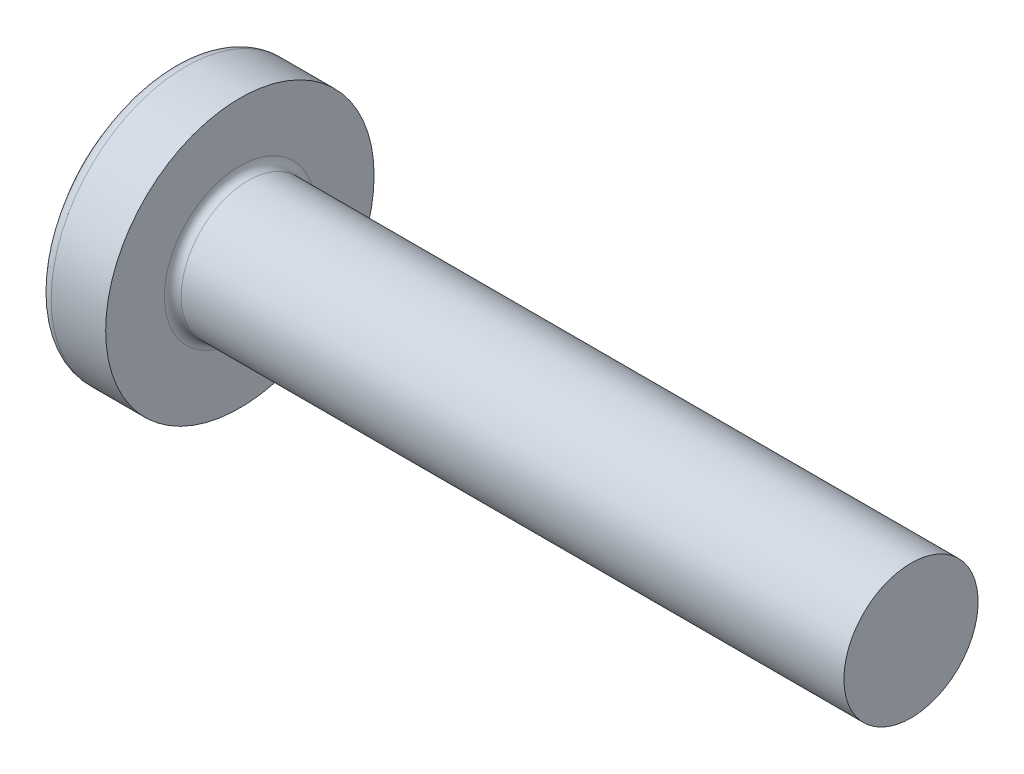
ISO-10303-21;
HEADER;
FILE_DESCRIPTION(('STEP AP214'),'2;1');
FILE_NAME('part.step','',(''),(''),'','','');
FILE_SCHEMA(('AUTOMOTIVE_DESIGN { 1 0 10303 214 1 1 1 1 }'));
ENDSEC;
DATA;
#1=APPLICATION_CONTEXT('core data for automotive mechanical design processes');
#2=APPLICATION_PROTOCOL_DEFINITION('international standard','automotive_design',2000,#1);
#3=PRODUCT_CONTEXT('',#1,'mechanical');
#4=PRODUCT('Part','Part','',(#3));
#5=PRODUCT_RELATED_PRODUCT_CATEGORY('part','',(#4));
#6=PRODUCT_DEFINITION_FORMATION('','',#4);
#7=PRODUCT_DEFINITION_CONTEXT('part definition',#1,'design');
#8=PRODUCT_DEFINITION('design','',#6,#7);
#9=PRODUCT_DEFINITION_SHAPE('','',#8);
#10=(LENGTH_UNIT() NAMED_UNIT(*) SI_UNIT(.MILLI.,.METRE.));
#11=(NAMED_UNIT(*) PLANE_ANGLE_UNIT() SI_UNIT($,.RADIAN.));
#12=(NAMED_UNIT(*) SI_UNIT($,.STERADIAN.) SOLID_ANGLE_UNIT());
#13=UNCERTAINTY_MEASURE_WITH_UNIT(LENGTH_MEASURE(1.E-05),#10,'distance_accuracy_value','');
#14=(GEOMETRIC_REPRESENTATION_CONTEXT(3) GLOBAL_UNCERTAINTY_ASSIGNED_CONTEXT((#13)) GLOBAL_UNIT_ASSIGNED_CONTEXT((#10,
#11,#12)) REPRESENTATION_CONTEXT('',''));
#15=CARTESIAN_POINT('',(0.,0.,0.));
#16=DIRECTION('',(0.,0.,1.));
#17=DIRECTION('',(1.,0.,0.));
#18=AXIS2_PLACEMENT_3D('',#15,#16,#17);
#19=CARTESIAN_POINT('',(2.5,0.,0.));
#20=DIRECTION('',(-1.,0.,0.));
#21=DIRECTION('',(0.,1.,0.));
#22=AXIS2_PLACEMENT_3D('',#19,#20,#21);
#23=SPHERICAL_SURFACE('',#22,2.5);
#24=CARTESIAN_POINT('',(0.532633828839689,0.,0.));
#25=DIRECTION('',(-1.,0.,0.));
#26=DIRECTION('',(0.,0.,1.));
#27=AXIS2_PLACEMENT_3D('',#24,#25,#26);
#28=CIRCLE('',#27,1.54255319148936);
#29=CARTESIAN_POINT('',(0.532633828839689,0.,1.54255319148936));
#30=VERTEX_POINT('',#29);
#31=EDGE_CURVE('E238',#30,#30,#28,.T.);
#32=ORIENTED_EDGE('',*,*,#31,.T.);
#33=EDGE_LOOP('',(#32));
#34=FACE_BOUND('',#33,.T.);
#35=CARTESIAN_POINT('',(0.0348536438778161,0.,0.));
#36=DIRECTION('',(1.,0.,0.));
#37=DIRECTION('',(0.,0.,-1.));
#38=AXIS2_PLACEMENT_3D('',#35,#36,#37);
#39=CIRCLE('',#38,0.415996926548163);
#40=CARTESIAN_POINT('',(0.0348536438778156,-0.239999999999998,-0.339784406495528));
#41=VERTEX_POINT('',#40);
#42=CARTESIAN_POINT('',(0.0348536438778159,-0.33978440649553,-0.24));
#43=VERTEX_POINT('',#42);
#44=EDGE_CURVE('E374',#41,#43,#39,.F.);
#45=ORIENTED_EDGE('',*,*,#44,.F.);
#46=CARTESIAN_POINT('',(2.5,-0.24,0.));
#47=DIRECTION('',(0.,1.,0.));
#48=DIRECTION('',(0.,0.,1.));
#49=AXIS2_PLACEMENT_3D('',#46,#47,#48);
#50=CIRCLE('',#49,2.48845333490504);
#51=CARTESIAN_POINT('',(0.12361367782094,-0.239999999999997,-0.738368504041365));
#52=VERTEX_POINT('',#51);
#53=EDGE_CURVE('E300',#52,#41,#50,.T.);
#54=ORIENTED_EDGE('',*,*,#53,.F.);
#55=CARTESIAN_POINT('',(2.32172308413752,0.,0.357568235162191));
#56=DIRECTION('',(0.446197753347437,0.,-0.894934391398442));
#57=DIRECTION('',(-0.894934391398442,0.,-0.446197753347437));
#58=AXIS2_PLACEMENT_3D('',#55,#56,#57);
#59=CIRCLE('',#58,2.46786594013402);
#60=CARTESIAN_POINT('',(0.12361367782094,0.240000000000003,-0.738368504041364));
#61=VERTEX_POINT('',#60);
#62=EDGE_CURVE('E272',#52,#61,#59,.T.);
#63=ORIENTED_EDGE('',*,*,#62,.T.);
#64=CARTESIAN_POINT('',(2.5,0.24,0.));
#65=DIRECTION('',(0.,-1.,0.));
#66=DIRECTION('',(0.,0.,-1.));
#67=AXIS2_PLACEMENT_3D('',#64,#65,#66);
#68=CIRCLE('',#67,2.48845333490504);
#69=CARTESIAN_POINT('',(0.0348536438778159,0.240000000000001,-0.339784406495526));
#70=VERTEX_POINT('',#69);
#71=EDGE_CURVE('E327',#70,#61,#68,.T.);
#72=ORIENTED_EDGE('',*,*,#71,.F.);
#73=CARTESIAN_POINT('',(0.0348536438778159,0.339784406495527,-0.24));
#74=VERTEX_POINT('',#73);
#75=EDGE_CURVE('E393',#74,#70,#39,.F.);
#76=ORIENTED_EDGE('',*,*,#75,.F.);
#77=CARTESIAN_POINT('',(2.5,0.,-0.24));
#78=DIRECTION('',(0.,0.,1.));
#79=DIRECTION('',(1.,0.,0.));
#80=AXIS2_PLACEMENT_3D('',#77,#78,#79);
#81=CIRCLE('',#80,2.48845333490504);
#82=CARTESIAN_POINT('',(0.12361367782094,0.738368504041364,-0.24));
#83=VERTEX_POINT('',#82);
#84=EDGE_CURVE('E266',#83,#74,#81,.T.);
#85=ORIENTED_EDGE('',*,*,#84,.F.);
#86=CARTESIAN_POINT('',(2.32172308413753,-0.357568235162189,0.));
#87=DIRECTION('',(0.446197753347436,0.894934391398443,0.));
#88=DIRECTION('',(-0.894934391398443,0.446197753347436,0.));
#89=AXIS2_PLACEMENT_3D('',#86,#87,#88);
#90=CIRCLE('',#89,2.46786594013402);
#91=CARTESIAN_POINT('',(0.123613677820941,0.738368504041364,0.239999999999999));
#92=VERTEX_POINT('',#91);
#93=EDGE_CURVE('E269',#83,#92,#90,.T.);
#94=ORIENTED_EDGE('',*,*,#93,.T.);
#95=CARTESIAN_POINT('',(2.5,0.,0.24));
#96=DIRECTION('',(0.,0.,-1.));
#97=DIRECTION('',(-1.,0.,0.));
#98=AXIS2_PLACEMENT_3D('',#95,#96,#97);
#99=CIRCLE('',#98,2.48845333490504);
#100=CARTESIAN_POINT('',(0.0348536438778159,0.339784406495527,0.239999999999999));
#101=VERTEX_POINT('',#100);
#102=EDGE_CURVE('E262',#101,#92,#99,.T.);
#103=ORIENTED_EDGE('',*,*,#102,.F.);
#104=CARTESIAN_POINT('',(0.0348536438778162,0.239999999999999,0.339784406495528));
#105=VERTEX_POINT('',#104);
#106=EDGE_CURVE('E392',#105,#101,#39,.F.);
#107=ORIENTED_EDGE('',*,*,#106,.F.);
#108=CARTESIAN_POINT('',(0.123613677820941,0.239999999999997,0.738368504041365));
#109=VERTEX_POINT('',#108);
#110=EDGE_CURVE('E282',#109,#105,#68,.T.);
#111=ORIENTED_EDGE('',*,*,#110,.F.);
#112=CARTESIAN_POINT('',(2.32172308413752,0.,-0.357568235162189));
#113=DIRECTION('',(0.446197753347436,0.,0.894934391398443));
#114=DIRECTION('',(0.894934391398443,0.,-0.446197753347436));
#115=AXIS2_PLACEMENT_3D('',#112,#113,#114);
#116=CIRCLE('',#115,2.46786594013402);
#117=CARTESIAN_POINT('',(0.12361367782094,-0.240000000000002,0.738368504041363));
#118=VERTEX_POINT('',#117);
#119=EDGE_CURVE('E49',#109,#118,#116,.T.);
#120=ORIENTED_EDGE('',*,*,#119,.T.);
#121=CARTESIAN_POINT('',(0.0348536438778154,-0.240000000000001,0.339784406495526));
#122=VERTEX_POINT('',#121);
#123=EDGE_CURVE('E279',#122,#118,#50,.T.);
#124=ORIENTED_EDGE('',*,*,#123,.F.);
#125=CARTESIAN_POINT('',(0.0348536438778159,-0.33978440649553,0.239999999999999));
#126=VERTEX_POINT('',#125);
#127=EDGE_CURVE('E432',#126,#122,#39,.F.);
#128=ORIENTED_EDGE('',*,*,#127,.F.);
#129=CARTESIAN_POINT('',(0.12361367782094,-0.738368504041364,0.239999999999999));
#130=VERTEX_POINT('',#129);
#131=EDGE_CURVE('E263',#130,#126,#99,.T.);
#132=ORIENTED_EDGE('',*,*,#131,.F.);
#133=CARTESIAN_POINT('',(2.32172308413752,0.35756823516219,0.));
#134=DIRECTION('',(0.446197753347437,-0.894934391398442,0.));
#135=DIRECTION('',(0.894934391398442,0.446197753347437,0.));
#136=AXIS2_PLACEMENT_3D('',#133,#134,#135);
#137=CIRCLE('',#136,2.46786594013402);
#138=CARTESIAN_POINT('',(0.12361367782094,-0.738368504041365,-0.24));
#139=VERTEX_POINT('',#138);
#140=EDGE_CURVE('E259',#130,#139,#137,.T.);
#141=ORIENTED_EDGE('',*,*,#140,.T.);
#142=EDGE_CURVE('E64',#43,#139,#81,.T.);
#143=ORIENTED_EDGE('',*,*,#142,.F.);
#144=EDGE_LOOP('',(#45,#54,#63,#72,#76,#85,#94,#103,#107,#111,#120,#124,#128,#132,#141,#143));
#145=FACE_BOUND('',#144,.T.);
#146=ADVANCED_FACE('F35',(#34,#145),#23,.T.);
#147=CARTESIAN_POINT('',(0.9,0.351276627792594,-0.24));
#148=DIRECTION('',(0.,0.,1.));
#149=DIRECTION('',(1.,0.,0.));
#150=AXIS2_PLACEMENT_3D('',#147,#148,#149);
#151=PLANE('',#150);
#152=ORIENTED_EDGE('',*,*,#84,.T.);
#153=CARTESIAN_POINT('',(-0.629305626090503,0.395285037112981,-0.24));
#154=CARTESIAN_POINT('',(-0.502245440869322,0.384885761504804,-0.24));
#155=CARTESIAN_POINT('',(-0.375193303991233,0.374386041200532,-0.24));
#156=CARTESIAN_POINT('',(-0.121109362358296,0.353102592236971,-0.24));
#157=CARTESIAN_POINT('',(0.00592244174754024,0.342318855839851,-0.24));
#158=CARTESIAN_POINT('',(0.259954553132912,0.320384813741064,-0.24));
#159=CARTESIAN_POINT('',(0.386954860411928,0.309234508033358,-0.24));
#160=CARTESIAN_POINT('',(0.640908035068629,0.286428502217992,-0.24));
#161=CARTESIAN_POINT('',(0.767860903211904,0.274772810656204,-0.24));
#162=CARTESIAN_POINT('',(1.02740505364569,0.250195813655407,-0.24));
#163=CARTESIAN_POINT('',(1.15999322223091,0.237241167273183,-0.24));
#164=CARTESIAN_POINT('',(1.35878055743696,0.216851377657748,-0.24));
#165=CARTESIAN_POINT('',(1.4250285388763,0.209894992147916,-0.24));
#166=CARTESIAN_POINT('',(1.55747716895973,0.195536747895849,-0.24));
#167=CARTESIAN_POINT('',(1.62367781680698,0.188134881824918,-0.24));
#168=CARTESIAN_POINT('',(1.68984631429509,0.180447253558873,-0.24));
#169=B_SPLINE_CURVE_WITH_KNOTS('',3,(#153,#154,#155,#156,#157,#158,#159,#160,#161,#162,#163,
#164,#165,#166,#167,#168),.UNSPECIFIED.,.F.,.F.,(4,2,2,2,2,2,2,4),(0.,0.382455333743982,
0.764921098031735,1.14738686861956,1.52984617438513,1.92950045825544,2.12933578679663,
2.3291744037699),.UNSPECIFIED.);
#170=CARTESIAN_POINT('',(0.9,0.262259890185289,-0.24));
#171=VERTEX_POINT('',#170);
#172=EDGE_CURVE('E416',#74,#171,#169,.T.);
#173=ORIENTED_EDGE('',*,*,#172,.T.);
#174=DIRECTION('',(0.,1.,0.));
#175=VECTOR('',#174,1.);
#176=CARTESIAN_POINT('',(0.9,-0.351276627792593,-0.24));
#177=LINE('',#176,#175);
#178=CARTESIAN_POINT('',(0.9,0.351276627792593,-0.24));
#179=VERTEX_POINT('',#178);
#180=EDGE_CURVE('E356',#171,#179,#177,.T.);
#181=ORIENTED_EDGE('',*,*,#180,.T.);
#182=DIRECTION('',(0.894934391398443,-0.446197753347436,0.));
#183=VECTOR('',#182,1.);
#184=CARTESIAN_POINT('',(0.,0.8,-0.24));
#185=LINE('',#184,#183);
#186=EDGE_CURVE('E239',#83,#179,#185,.T.);
#187=ORIENTED_EDGE('',*,*,#186,.F.);
#188=EDGE_LOOP('',(#152,#173,#181,#187));
#189=FACE_BOUND('',#188,.T.);
#190=ADVANCED_FACE('F194',(#189),#151,.T.);
#191=CARTESIAN_POINT('',(0.9,-0.351276627792593,-0.24));
#192=VERTEX_POINT('',#191);
#193=CARTESIAN_POINT('',(0.9,-0.262259890185289,-0.24));
#194=VERTEX_POINT('',#193);
#195=EDGE_CURVE('E247',#192,#194,#177,.T.);
#196=ORIENTED_EDGE('',*,*,#195,.T.);
#197=CARTESIAN_POINT('',(-0.629305626090503,-0.395285037112981,-0.24));
#198=CARTESIAN_POINT('',(-0.502245440869323,-0.384885761504804,-0.24));
#199=CARTESIAN_POINT('',(-0.375193303991233,-0.374386041200532,-0.24));
#200=CARTESIAN_POINT('',(-0.121109362358297,-0.353102592236971,-0.24));
#201=CARTESIAN_POINT('',(0.00592244174753992,-0.342318855839851,-0.24));
#202=CARTESIAN_POINT('',(0.259954553132912,-0.320384813741064,-0.24));
#203=CARTESIAN_POINT('',(0.386954860411928,-0.309234508033358,-0.24));
#204=CARTESIAN_POINT('',(0.640908035068628,-0.286428502217992,-0.24));
#205=CARTESIAN_POINT('',(0.767860903211904,-0.274772810656204,-0.24));
#206=CARTESIAN_POINT('',(1.02740505364568,-0.250195813655408,-0.24));
#207=CARTESIAN_POINT('',(1.15999322223089,-0.237241167273185,-0.24));
#208=CARTESIAN_POINT('',(1.35878055743692,-0.216851377657751,-0.24));
#209=CARTESIAN_POINT('',(1.42502853887626,-0.209894992147921,-0.24));
#210=CARTESIAN_POINT('',(1.55747716895968,-0.195536747895854,-0.24));
#211=CARTESIAN_POINT('',(1.62367781680693,-0.188134881824924,-0.24));
#212=CARTESIAN_POINT('',(1.68984631429502,-0.18044725355888,-0.24));
#213=B_SPLINE_CURVE_WITH_KNOTS('',3,(#197,#198,#199,#200,#201,#202,#203,#204,#205,#206,#207,
#208,#209,#210,#211,#212),.UNSPECIFIED.,.F.,.F.,(4,2,2,2,2,2,2,4),(0.,0.382455333743982,
0.764921098031735,1.14738686861956,1.52984617438513,1.92950045825541,2.12933578679658,
2.32917440376984),.UNSPECIFIED.);
#214=EDGE_CURVE('E391',#194,#43,#213,.F.);
#215=ORIENTED_EDGE('',*,*,#214,.T.);
#216=ORIENTED_EDGE('',*,*,#142,.T.);
#217=DIRECTION('',(0.894934391398442,0.446197753347437,0.));
#218=VECTOR('',#217,1.);
#219=CARTESIAN_POINT('',(0.,-0.800000000000001,-0.24));
#220=LINE('',#219,#218);
#221=EDGE_CURVE('E330',#139,#192,#220,.T.);
#222=ORIENTED_EDGE('',*,*,#221,.T.);
#223=EDGE_LOOP('',(#196,#215,#216,#222));
#224=FACE_BOUND('',#223,.T.);
#225=ADVANCED_FACE('F200',(#224),#151,.T.);
#226=CARTESIAN_POINT('',(0.9,-0.351276627792594,0.24));
#227=DIRECTION('',(0.,0.,-1.));
#228=DIRECTION('',(-1.,0.,0.));
#229=AXIS2_PLACEMENT_3D('',#226,#227,#228);
#230=PLANE('',#229);
#231=DIRECTION('',(0.,-1.,0.));
#232=VECTOR('',#231,1.);
#233=CARTESIAN_POINT('',(0.9,0.351276627792594,0.24));
#234=LINE('',#233,#232);
#235=CARTESIAN_POINT('',(0.9,0.351276627792594,0.24));
#236=VERTEX_POINT('',#235);
#237=CARTESIAN_POINT('',(0.9,0.262259890185289,0.24));
#238=VERTEX_POINT('',#237);
#239=EDGE_CURVE('E339',#236,#238,#234,.T.);
#240=ORIENTED_EDGE('',*,*,#239,.T.);
#241=CARTESIAN_POINT('',(-0.629305630567792,0.395285037479254,0.239999999999999));
#242=CARTESIAN_POINT('',(-0.502245444906561,0.384885761837513,0.239999999999999));
#243=CARTESIAN_POINT('',(-0.37519330758842,0.374386041499475,0.239999999999999));
#244=CARTESIAN_POINT('',(-0.121109365075988,0.353102592467066,0.239999999999999));
#245=CARTESIAN_POINT('',(0.00592243946929226,0.342318856034865,0.239999999999999));
#246=CARTESIAN_POINT('',(0.259954552394605,0.320384813806507,0.24));
#247=CARTESIAN_POINT('',(0.386954860773954,0.309234508002403,0.24));
#248=CARTESIAN_POINT('',(0.640908037631127,0.28642850198631,0.24));
#249=CARTESIAN_POINT('',(0.767860906874543,0.274772810320191,0.24));
#250=CARTESIAN_POINT('',(1.02740503497565,0.250195815411899,0.24));
#251=CARTESIAN_POINT('',(1.15999318014165,0.237241171372315,0.24));
#252=CARTESIAN_POINT('',(1.35878048026028,0.216851385682781,0.24));
#253=CARTESIAN_POINT('',(1.42502845000984,0.209895001550344,0.24));
#254=CARTESIAN_POINT('',(1.55747705673951,0.195536760284766,0.24));
#255=CARTESIAN_POINT('',(1.62367769292278,0.188134895822939,0.24));
#256=CARTESIAN_POINT('',(1.68984617876651,0.180447269328964,0.24));
#257=B_SPLINE_CURVE_WITH_KNOTS('',3,(#241,#242,#243,#244,#245,#246,#247,#248,#249,#250,#251,
#252,#253,#254,#255,#256),.UNSPECIFIED.,.F.,.F.,(4,2,2,2,2,2,2,4),(0.,0.382455335067977,
0.764921100678223,1.14738687457974,1.52984618366023,1.92950039692502,2.1293356901582,
2.32917427182044),.UNSPECIFIED.);
#258=EDGE_CURVE('E671',#238,#101,#257,.F.);
#259=ORIENTED_EDGE('',*,*,#258,.T.);
#260=ORIENTED_EDGE('',*,*,#102,.T.);
#261=DIRECTION('',(0.894934391398443,-0.446197753347435,0.));
#262=VECTOR('',#261,1.);
#263=CARTESIAN_POINT('',(0.,0.8,0.239999999999999));
#264=LINE('',#263,#262);
#265=EDGE_CURVE('E244',#92,#236,#264,.T.);
#266=ORIENTED_EDGE('',*,*,#265,.T.);
#267=EDGE_LOOP('',(#240,#259,#260,#266));
#268=FACE_BOUND('',#267,.T.);
#269=ADVANCED_FACE('F412',(#268),#230,.T.);
#270=ORIENTED_EDGE('',*,*,#131,.T.);
#271=CARTESIAN_POINT('',(-0.629305630567792,-0.395285037479254,0.239999999999999));
#272=CARTESIAN_POINT('',(-0.502245444906562,-0.384885761837513,0.239999999999999));
#273=CARTESIAN_POINT('',(-0.37519330758842,-0.374386041499475,0.239999999999999));
#274=CARTESIAN_POINT('',(-0.121109365075988,-0.353102592467066,0.239999999999999));
#275=CARTESIAN_POINT('',(0.00592243946929229,-0.342318856034865,0.239999999999999));
#276=CARTESIAN_POINT('',(0.259954552394605,-0.320384813806507,0.24));
#277=CARTESIAN_POINT('',(0.386954860773954,-0.309234508002403,0.24));
#278=CARTESIAN_POINT('',(0.640908037631127,-0.28642850198631,0.24));
#279=CARTESIAN_POINT('',(0.767860906874543,-0.274772810320191,0.24));
#280=CARTESIAN_POINT('',(1.02740503497566,-0.250195815411899,0.24));
#281=CARTESIAN_POINT('',(1.15999318014166,-0.237241171372314,0.24));
#282=CARTESIAN_POINT('',(1.35878048026028,-0.21685138568278,0.24));
#283=CARTESIAN_POINT('',(1.42502845000984,-0.209895001550344,0.24));
#284=CARTESIAN_POINT('',(1.55747705673952,-0.195536760284765,0.24));
#285=CARTESIAN_POINT('',(1.6236776929228,-0.188134895822938,0.24));
#286=CARTESIAN_POINT('',(1.68984617876652,-0.180447269328962,0.24));
#287=B_SPLINE_CURVE_WITH_KNOTS('',3,(#271,#272,#273,#274,#275,#276,#277,#278,#279,#280,#281,
#282,#283,#284,#285,#286),.UNSPECIFIED.,.F.,.F.,(4,2,2,2,2,2,2,4),(0.,0.382455335067977,
0.764921100678223,1.14738687457974,1.52984618366023,1.92950039692503,2.1293356901582,
2.32917427182045),.UNSPECIFIED.);
#288=CARTESIAN_POINT('',(0.9,-0.262259890185289,0.24));
#289=VERTEX_POINT('',#288);
#290=EDGE_CURVE('E433',#126,#289,#287,.T.);
#291=ORIENTED_EDGE('',*,*,#290,.T.);
#292=CARTESIAN_POINT('',(0.9,-0.351276627792593,0.24));
#293=VERTEX_POINT('',#292);
#294=EDGE_CURVE('E341',#289,#293,#234,.T.);
#295=ORIENTED_EDGE('',*,*,#294,.T.);
#296=DIRECTION('',(0.894934391398442,0.446197753347436,0.));
#297=VECTOR('',#296,1.);
#298=CARTESIAN_POINT('',(0.,-0.800000000000001,0.239999999999999));
#299=LINE('',#298,#297);
#300=EDGE_CURVE('E332',#130,#293,#299,.T.);
#301=ORIENTED_EDGE('',*,*,#300,.F.);
#302=EDGE_LOOP('',(#270,#291,#295,#301));
#303=FACE_BOUND('',#302,.T.);
#304=ADVANCED_FACE('F519',(#303),#230,.T.);
#305=CARTESIAN_POINT('',(0.9,0.351276627792594,0.24));
#306=DIRECTION('',(0.446197753347436,0.894934391398443,0.));
#307=DIRECTION('',(-0.894934391398443,0.446197753347436,0.));
#308=AXIS2_PLACEMENT_3D('',#305,#306,#307);
#309=PLANE('',#308);
#310=CARTESIAN_POINT('',(1.51667990224654,0.0438114218941492,0.));
#311=DIRECTION('',(0.446197753347436,0.894934391398443,0.));
#312=DIRECTION('',(-0.894934391398443,0.446197753347436,0.));
#313=AXIS2_PLACEMENT_3D('',#310,#311,#312);
#314=ELLIPSE('',#313,0.700087658673247,0.30928997249648);
#315=CARTESIAN_POINT('',(0.9,0.351276627792594,0.0546349775021748));
#316=VERTEX_POINT('',#315);
#317=CARTESIAN_POINT('',(0.9,0.351276627792594,-0.0546349775021751));
#318=VERTEX_POINT('',#317);
#319=EDGE_CURVE('E305',#316,#318,#314,.F.);
#320=ORIENTED_EDGE('',*,*,#319,.F.);
#321=DIRECTION('',(0.,0.,-1.));
#322=VECTOR('',#321,1.);
#323=CARTESIAN_POINT('',(0.9,0.351276627792594,0.24));
#324=LINE('',#323,#322);
#325=EDGE_CURVE('E342',#236,#316,#324,.T.);
#326=ORIENTED_EDGE('',*,*,#325,.F.);
#327=ORIENTED_EDGE('',*,*,#265,.F.);
#328=ORIENTED_EDGE('',*,*,#93,.F.);
#329=ORIENTED_EDGE('',*,*,#186,.T.);
#330=EDGE_CURVE('E344',#318,#179,#324,.T.);
#331=ORIENTED_EDGE('',*,*,#330,.F.);
#332=EDGE_LOOP('',(#320,#326,#327,#328,#329,#331));
#333=FACE_BOUND('',#332,.T.);
#334=ADVANCED_FACE('F410',(#333),#309,.F.);
#335=CARTESIAN_POINT('',(0.,-0.800000000000001,-0.24));
#336=DIRECTION('',(0.446197753347437,-0.894934391398442,0.));
#337=DIRECTION('',(0.894934391398442,0.446197753347437,0.));
#338=AXIS2_PLACEMENT_3D('',#335,#336,#337);
#339=PLANE('',#338);
#340=CARTESIAN_POINT('',(1.51667990224654,-0.0438114218941492,0.));
#341=DIRECTION('',(0.446197753347437,-0.894934391398442,0.));
#342=DIRECTION('',(-0.894934391398442,-0.446197753347437,0.));
#343=AXIS2_PLACEMENT_3D('',#340,#341,#342);
#344=ELLIPSE('',#343,0.700087658673245,0.30928997249648);
#345=CARTESIAN_POINT('',(0.9,-0.351276627792594,-0.0546349775021766));
#346=VERTEX_POINT('',#345);
#347=CARTESIAN_POINT('',(0.9,-0.351276627792594,0.0546349775021763));
#348=VERTEX_POINT('',#347);
#349=EDGE_CURVE('E673',#346,#348,#344,.F.);
#350=ORIENTED_EDGE('',*,*,#349,.F.);
#351=DIRECTION('',(0.,0.,1.));
#352=VECTOR('',#351,1.);
#353=CARTESIAN_POINT('',(0.9,-0.351276627792593,-0.24));
#354=LINE('',#353,#352);
#355=EDGE_CURVE('E335',#192,#346,#354,.T.);
#356=ORIENTED_EDGE('',*,*,#355,.F.);
#357=ORIENTED_EDGE('',*,*,#221,.F.);
#358=ORIENTED_EDGE('',*,*,#140,.F.);
#359=ORIENTED_EDGE('',*,*,#300,.T.);
#360=EDGE_CURVE('E338',#348,#293,#354,.T.);
#361=ORIENTED_EDGE('',*,*,#360,.F.);
#362=EDGE_LOOP('',(#350,#356,#357,#358,#359,#361));
#363=FACE_BOUND('',#362,.T.);
#364=ADVANCED_FACE('F506',(#363),#339,.F.);
#365=CARTESIAN_POINT('',(0.9,0.351276627792593,-0.24));
#366=DIRECTION('',(-1.,0.,0.));
#367=DIRECTION('',(0.,0.,1.));
#368=AXIS2_PLACEMENT_3D('',#365,#366,#367);
#369=PLANE('',#368);
#370=DIRECTION('',(0.,1.,0.));
#371=VECTOR('',#370,1.);
#372=CARTESIAN_POINT('',(0.9,-0.240000000000001,0.351276627792593));
#373=LINE('',#372,#371);
#374=CARTESIAN_POINT('',(0.9,-0.240000000000001,0.351276627792593));
#375=VERTEX_POINT('',#374);
#376=CARTESIAN_POINT('',(0.9,-0.0546349775021793,0.351276627792594));
#377=VERTEX_POINT('',#376);
#378=EDGE_CURVE('E320',#375,#377,#373,.T.);
#379=ORIENTED_EDGE('',*,*,#378,.T.);
#380=CARTESIAN_POINT('',(0.9,0.,0.));
#381=DIRECTION('',(-1.,0.,0.));
#382=DIRECTION('',(0.,0.,1.));
#383=AXIS2_PLACEMENT_3D('',#380,#381,#382);
#384=CIRCLE('',#383,0.3555);
#385=CARTESIAN_POINT('',(0.9,-0.240000000000001,0.262259890185289));
#386=VERTEX_POINT('',#385);
#387=EDGE_CURVE('E701',#386,#377,#384,.T.);
#388=ORIENTED_EDGE('',*,*,#387,.F.);
#389=DIRECTION('',(0.,0.,-1.));
#390=VECTOR('',#389,1.);
#391=CARTESIAN_POINT('',(0.9,-0.240000000000001,0.351276627792593));
#392=LINE('',#391,#390);
#393=EDGE_CURVE('E316',#375,#386,#392,.T.);
#394=ORIENTED_EDGE('',*,*,#393,.F.);
#395=EDGE_LOOP('',(#379,#388,#394));
#396=FACE_BOUND('',#395,.T.);
#397=ADVANCED_FACE('F499',(#396),#369,.T.);
#398=ORIENTED_EDGE('',*,*,#294,.F.);
#399=EDGE_CURVE('E706',#348,#289,#384,.T.);
#400=ORIENTED_EDGE('',*,*,#399,.F.);
#401=ORIENTED_EDGE('',*,*,#360,.T.);
#402=EDGE_LOOP('',(#398,#400,#401));
#403=FACE_BOUND('',#402,.T.);
#404=ADVANCED_FACE('F492',(#403),#369,.T.);
#405=ORIENTED_EDGE('',*,*,#355,.T.);
#406=EDGE_CURVE('E385',#194,#346,#384,.T.);
#407=ORIENTED_EDGE('',*,*,#406,.F.);
#408=ORIENTED_EDGE('',*,*,#195,.F.);
#409=EDGE_LOOP('',(#405,#407,#408));
#410=FACE_BOUND('',#409,.T.);
#411=ADVANCED_FACE('F486',(#410),#369,.T.);
#412=CARTESIAN_POINT('',(0.9,-0.239999999999999,-0.262259890185289));
#413=VERTEX_POINT('',#412);
#414=CARTESIAN_POINT('',(0.9,-0.239999999999999,-0.351276627792594));
#415=VERTEX_POINT('',#414);
#416=EDGE_CURVE('E319',#413,#415,#392,.T.);
#417=ORIENTED_EDGE('',*,*,#416,.F.);
#418=CARTESIAN_POINT('',(0.9,-0.0546349775021792,-0.351276627792594));
#419=VERTEX_POINT('',#418);
#420=EDGE_CURVE('E56',#419,#413,#384,.T.);
#421=ORIENTED_EDGE('',*,*,#420,.F.);
#422=DIRECTION('',(0.,-1.,0.));
#423=VECTOR('',#422,1.);
#424=CARTESIAN_POINT('',(0.9,0.240000000000001,-0.351276627792592));
#425=LINE('',#424,#423);
#426=EDGE_CURVE('E315',#419,#415,#425,.T.);
#427=ORIENTED_EDGE('',*,*,#426,.T.);
#428=EDGE_LOOP('',(#417,#421,#427));
#429=FACE_BOUND('',#428,.T.);
#430=ADVANCED_FACE('F380',(#429),#369,.T.);
#431=CARTESIAN_POINT('',(0.9,0.240000000000001,-0.351276627792592));
#432=VERTEX_POINT('',#431);
#433=CARTESIAN_POINT('',(0.9,0.0546349775021817,-0.351276627792593));
#434=VERTEX_POINT('',#433);
#435=EDGE_CURVE('E312',#432,#434,#425,.T.);
#436=ORIENTED_EDGE('',*,*,#435,.T.);
#437=CARTESIAN_POINT('',(0.9,0.240000000000001,-0.262259890185288));
#438=VERTEX_POINT('',#437);
#439=EDGE_CURVE('E384',#438,#434,#384,.T.);
#440=ORIENTED_EDGE('',*,*,#439,.F.);
#441=DIRECTION('',(0.,0.,1.));
#442=VECTOR('',#441,1.);
#443=CARTESIAN_POINT('',(0.9,0.240000000000001,-0.351276627792592));
#444=LINE('',#443,#442);
#445=EDGE_CURVE('E324',#432,#438,#444,.T.);
#446=ORIENTED_EDGE('',*,*,#445,.F.);
#447=EDGE_LOOP('',(#436,#440,#446));
#448=FACE_BOUND('',#447,.T.);
#449=ADVANCED_FACE('F474',(#448),#369,.T.);
#450=ORIENTED_EDGE('',*,*,#180,.F.);
#451=EDGE_CURVE('E690',#318,#171,#384,.T.);
#452=ORIENTED_EDGE('',*,*,#451,.F.);
#453=ORIENTED_EDGE('',*,*,#330,.T.);
#454=EDGE_LOOP('',(#450,#452,#453));
#455=FACE_BOUND('',#454,.T.);
#456=ADVANCED_FACE('F467',(#455),#369,.T.);
#457=ORIENTED_EDGE('',*,*,#325,.T.);
#458=EDGE_CURVE('E692',#238,#316,#384,.T.);
#459=ORIENTED_EDGE('',*,*,#458,.F.);
#460=ORIENTED_EDGE('',*,*,#239,.F.);
#461=EDGE_LOOP('',(#457,#459,#460));
#462=FACE_BOUND('',#461,.T.);
#463=ADVANCED_FACE('F461',(#462),#369,.T.);
#464=CARTESIAN_POINT('',(0.9,0.239999999999999,0.351276627792594));
#465=DIRECTION('',(0.,-1.,0.));
#466=DIRECTION('',(1.,0.,0.));
#467=AXIS2_PLACEMENT_3D('',#464,#465,#466);
#468=PLANE('',#467);
#469=ORIENTED_EDGE('',*,*,#110,.T.);
#470=CARTESIAN_POINT('',(-0.629305630567791,0.239999999999999,0.395285037479254));
#471=CARTESIAN_POINT('',(-0.502245444906562,0.239999999999999,0.384885761837514));
#472=CARTESIAN_POINT('',(-0.37519330758842,0.239999999999999,0.374386041499476));
#473=CARTESIAN_POINT('',(-0.121109365075988,0.239999999999999,0.353102592467067));
#474=CARTESIAN_POINT('',(0.00592243946929239,0.239999999999999,0.342318856034865));
#475=CARTESIAN_POINT('',(0.259954552394605,0.239999999999999,0.320384813806507));
#476=CARTESIAN_POINT('',(0.386954860773954,0.239999999999999,0.309234508002404));
#477=CARTESIAN_POINT('',(0.640908037631127,0.239999999999999,0.286428501986311));
#478=CARTESIAN_POINT('',(0.767860906874543,0.239999999999999,0.274772810320191));
#479=CARTESIAN_POINT('',(1.02740503497568,0.239999999999999,0.250195815411897));
#480=CARTESIAN_POINT('',(1.1599931801417,0.239999999999999,0.23724117137231));
#481=CARTESIAN_POINT('',(1.35878048026036,0.239999999999999,0.216851385682773));
#482=CARTESIAN_POINT('',(1.42502845000994,0.239999999999999,0.209895001550335));
#483=CARTESIAN_POINT('',(1.55747705673963,0.239999999999999,0.195536760284753));
#484=CARTESIAN_POINT('',(1.62367769292292,0.239999999999999,0.188134895822925));
#485=CARTESIAN_POINT('',(1.68984617876666,0.239999999999999,0.180447269328947));
#486=B_SPLINE_CURVE_WITH_KNOTS('',3,(#470,#471,#472,#473,#474,#475,#476,#477,#478,#479,#480,
#481,#482,#483,#484,#485),.UNSPECIFIED.,.F.,.F.,(4,2,2,2,2,2,2,4),(0.,0.382455335067977,
0.764921100678223,1.14738687457974,1.52984618366023,1.9295003969251,2.12933569015831,
2.32917427182059),.UNSPECIFIED.);
#487=CARTESIAN_POINT('',(0.9,0.239999999999999,0.26225989018529));
#488=VERTEX_POINT('',#487);
#489=EDGE_CURVE('E670',#105,#488,#486,.T.);
#490=ORIENTED_EDGE('',*,*,#489,.T.);
#491=CARTESIAN_POINT('',(0.9,0.239999999999999,0.351276627792594));
#492=VERTEX_POINT('',#491);
#493=EDGE_CURVE('E297',#488,#492,#444,.T.);
#494=ORIENTED_EDGE('',*,*,#493,.T.);
#495=DIRECTION('',(0.894934391398443,0.,-0.446197753347436));
#496=VECTOR('',#495,1.);
#497=CARTESIAN_POINT('',(0.,0.239999999999997,0.800000000000001));
#498=LINE('',#497,#496);
#499=EDGE_CURVE('E290',#109,#492,#498,.T.);
#500=ORIENTED_EDGE('',*,*,#499,.F.);
#501=EDGE_LOOP('',(#469,#490,#494,#500));
#502=FACE_BOUND('',#501,.T.);
#503=ADVANCED_FACE('F294',(#502),#468,.T.);
#504=CARTESIAN_POINT('',(0.9,-0.239999999999999,-0.351276627792594));
#505=DIRECTION('',(0.,1.,0.));
#506=DIRECTION('',(-1.,0.,0.));
#507=AXIS2_PLACEMENT_3D('',#504,#505,#506);
#508=PLANE('',#507);
#509=ORIENTED_EDGE('',*,*,#393,.T.);
#510=CARTESIAN_POINT('',(-0.629305630567792,-0.240000000000001,0.395285037479253));
#511=CARTESIAN_POINT('',(-0.502245444906561,-0.240000000000001,0.384885761837512));
#512=CARTESIAN_POINT('',(-0.37519330758842,-0.240000000000001,0.374386041499475));
#513=CARTESIAN_POINT('',(-0.121109365075988,-0.240000000000001,0.353102592467065));
#514=CARTESIAN_POINT('',(0.00592243946929237,-0.240000000000001,0.342318856034864));
#515=CARTESIAN_POINT('',(0.259954552394605,-0.240000000000001,0.320384813806506));
#516=CARTESIAN_POINT('',(0.386954860773954,-0.240000000000001,0.309234508002402));
#517=CARTESIAN_POINT('',(0.640908037631127,-0.240000000000001,0.286428501986309));
#518=CARTESIAN_POINT('',(0.767860906874543,-0.240000000000001,0.27477281032019));
#519=CARTESIAN_POINT('',(1.02740503497565,-0.240000000000001,0.250195815411898));
#520=CARTESIAN_POINT('',(1.15999318014165,-0.240000000000001,0.237241171372314));
#521=CARTESIAN_POINT('',(1.35878048026027,-0.240000000000001,0.216851385682781));
#522=CARTESIAN_POINT('',(1.42502845000983,-0.240000000000001,0.209895001550344));
#523=CARTESIAN_POINT('',(1.5574770567395,-0.240000000000001,0.195536760284766));
#524=CARTESIAN_POINT('',(1.62367769292278,-0.240000000000001,0.188134895822939));
#525=CARTESIAN_POINT('',(1.6898461787665,-0.240000000000001,0.180447269328963));
#526=B_SPLINE_CURVE_WITH_KNOTS('',3,(#510,#511,#512,#513,#514,#515,#516,#517,#518,#519,#520,
#521,#522,#523,#524,#525),.UNSPECIFIED.,.F.,.F.,(4,2,2,2,2,2,2,4),(0.,0.382455335067977,
0.764921100678223,1.14738687457974,1.52984618366023,1.92950039692502,2.12933569015819,
2.32917427182044),.UNSPECIFIED.);
#527=EDGE_CURVE('E425',#386,#122,#526,.F.);
#528=ORIENTED_EDGE('',*,*,#527,.T.);
#529=ORIENTED_EDGE('',*,*,#123,.T.);
#530=DIRECTION('',(0.894934391398443,0.,-0.446197753347435));
#531=VECTOR('',#530,1.);
#532=CARTESIAN_POINT('',(0.,-0.240000000000002,0.799999999999999));
#533=LINE('',#532,#531);
#534=EDGE_CURVE('E292',#118,#375,#533,.T.);
#535=ORIENTED_EDGE('',*,*,#534,.T.);
#536=EDGE_LOOP('',(#509,#528,#529,#535));
#537=FACE_BOUND('',#536,.T.);
#538=ADVANCED_FACE('F229',(#537),#508,.T.);
#539=CARTESIAN_POINT('',(0.9,-0.240000000000001,0.351276627792593));
#540=DIRECTION('',(0.446197753347436,0.,0.894934391398443));
#541=DIRECTION('',(-0.894934391398443,0.,0.446197753347436));
#542=AXIS2_PLACEMENT_3D('',#539,#540,#541);
#543=PLANE('',#542);
#544=CARTESIAN_POINT('',(1.51667990224654,0.,0.0438114218941492));
#545=DIRECTION('',(0.446197753347436,0.,0.894934391398443));
#546=DIRECTION('',(-0.894934391398443,0.,0.446197753347436));
#547=AXIS2_PLACEMENT_3D('',#544,#545,#546);
#548=ELLIPSE('',#547,0.700087658673247,0.30928997249648);
#549=CARTESIAN_POINT('',(0.9,0.0546349775021772,0.351276627792594));
#550=VERTEX_POINT('',#549);
#551=EDGE_CURVE('E423',#377,#550,#548,.F.);
#552=ORIENTED_EDGE('',*,*,#551,.F.);
#553=ORIENTED_EDGE('',*,*,#378,.F.);
#554=ORIENTED_EDGE('',*,*,#534,.F.);
#555=ORIENTED_EDGE('',*,*,#119,.F.);
#556=ORIENTED_EDGE('',*,*,#499,.T.);
#557=EDGE_CURVE('E323',#550,#492,#373,.T.);
#558=ORIENTED_EDGE('',*,*,#557,.F.);
#559=EDGE_LOOP('',(#552,#553,#554,#555,#556,#558));
#560=FACE_BOUND('',#559,.T.);
#561=ADVANCED_FACE('F288',(#560),#543,.F.);
#562=CARTESIAN_POINT('',(0.,0.240000000000003,-0.8));
#563=DIRECTION('',(0.446197753347437,0.,-0.894934391398442));
#564=DIRECTION('',(0.894934391398442,0.,0.446197753347437));
#565=AXIS2_PLACEMENT_3D('',#562,#563,#564);
#566=PLANE('',#565);
#567=CARTESIAN_POINT('',(1.51667990224654,0.,-0.0438114218941492));
#568=DIRECTION('',(0.446197753347437,0.,-0.894934391398442));
#569=DIRECTION('',(-0.894934391398442,0.,-0.446197753347437));
#570=AXIS2_PLACEMENT_3D('',#567,#568,#569);
#571=ELLIPSE('',#570,0.700087658673245,0.30928997249648);
#572=EDGE_CURVE('E378',#434,#419,#571,.F.);
#573=ORIENTED_EDGE('',*,*,#572,.F.);
#574=ORIENTED_EDGE('',*,*,#435,.F.);
#575=DIRECTION('',(0.894934391398442,0.,0.446197753347437));
#576=VECTOR('',#575,1.);
#577=CARTESIAN_POINT('',(0.,0.240000000000003,-0.8));
#578=LINE('',#577,#576);
#579=EDGE_CURVE('E302',#61,#432,#578,.T.);
#580=ORIENTED_EDGE('',*,*,#579,.F.);
#581=ORIENTED_EDGE('',*,*,#62,.F.);
#582=DIRECTION('',(0.894934391398442,0.,0.446197753347436));
#583=VECTOR('',#582,1.);
#584=CARTESIAN_POINT('',(0.,-0.239999999999997,-0.800000000000002));
#585=LINE('',#584,#583);
#586=EDGE_CURVE('E309',#52,#415,#585,.T.);
#587=ORIENTED_EDGE('',*,*,#586,.T.);
#588=ORIENTED_EDGE('',*,*,#426,.F.);
#589=EDGE_LOOP('',(#573,#574,#580,#581,#587,#588));
#590=FACE_BOUND('',#589,.T.);
#591=ADVANCED_FACE('F369',(#590),#566,.F.);
#592=ORIENTED_EDGE('',*,*,#445,.T.);
#593=CARTESIAN_POINT('',(-0.629305630567791,0.240000000000001,-0.395285037479253));
#594=CARTESIAN_POINT('',(-0.502245444906561,0.240000000000001,-0.384885761837512));
#595=CARTESIAN_POINT('',(-0.37519330758842,0.240000000000001,-0.374386041499474));
#596=CARTESIAN_POINT('',(-0.121109365075988,0.240000000000001,-0.353102592467065));
#597=CARTESIAN_POINT('',(0.00592243946929253,0.240000000000001,-0.342318856034864));
#598=CARTESIAN_POINT('',(0.259954552394605,0.240000000000001,-0.320384813806505));
#599=CARTESIAN_POINT('',(0.386954860773954,0.240000000000001,-0.309234508002402));
#600=CARTESIAN_POINT('',(0.640908037631127,0.240000000000001,-0.286428501986309));
#601=CARTESIAN_POINT('',(0.767860906874543,0.240000000000001,-0.27477281032019));
#602=CARTESIAN_POINT('',(1.02740503497569,0.240000000000001,-0.250195815411894));
#603=CARTESIAN_POINT('',(1.15999318014172,0.240000000000001,-0.237241171372307));
#604=CARTESIAN_POINT('',(1.3587804802604,0.240000000000001,-0.216851385682768));
#605=CARTESIAN_POINT('',(1.42502845000997,0.240000000000001,-0.209895001550329));
#606=CARTESIAN_POINT('',(1.55747705673968,0.240000000000001,-0.195536760284746));
#607=CARTESIAN_POINT('',(1.62367769292297,0.240000000000001,-0.188134895822917));
#608=CARTESIAN_POINT('',(1.68984617876671,0.240000000000001,-0.180447269328939));
#609=B_SPLINE_CURVE_WITH_KNOTS('',3,(#593,#594,#595,#596,#597,#598,#599,#600,#601,#602,#603,
#604,#605,#606,#607,#608),.UNSPECIFIED.,.F.,.F.,(4,2,2,2,2,2,2,4),(0.,0.382455335067977,
0.764921100678223,1.14738687457974,1.52984618366022,1.92950039692513,2.12933569015835,
2.32917427182065),.UNSPECIFIED.);
#610=EDGE_CURVE('E365',#438,#70,#609,.F.);
#611=ORIENTED_EDGE('',*,*,#610,.T.);
#612=ORIENTED_EDGE('',*,*,#71,.T.);
#613=ORIENTED_EDGE('',*,*,#579,.T.);
#614=EDGE_LOOP('',(#592,#611,#612,#613));
#615=FACE_BOUND('',#614,.T.);
#616=ADVANCED_FACE('F227',(#615),#468,.T.);
#617=ORIENTED_EDGE('',*,*,#53,.T.);
#618=CARTESIAN_POINT('',(-0.629305626090503,-0.239999999999998,-0.395285037112982));
#619=CARTESIAN_POINT('',(-0.502245440869323,-0.239999999999998,-0.384885761504806));
#620=CARTESIAN_POINT('',(-0.375193303991233,-0.239999999999998,-0.374386041200534));
#621=CARTESIAN_POINT('',(-0.121109362358297,-0.239999999999998,-0.353102592236972));
#622=CARTESIAN_POINT('',(0.00592244174753986,-0.239999999999998,-0.342318855839852));
#623=CARTESIAN_POINT('',(0.259954553132912,-0.239999999999998,-0.320384813741065));
#624=CARTESIAN_POINT('',(0.386954860411928,-0.239999999999999,-0.309234508033359));
#625=CARTESIAN_POINT('',(0.640908035068629,-0.239999999999999,-0.286428502217993));
#626=CARTESIAN_POINT('',(0.767860903211904,-0.239999999999999,-0.274772810656205));
#627=CARTESIAN_POINT('',(1.02740505364565,-0.239999999999999,-0.250195813655411));
#628=CARTESIAN_POINT('',(1.15999322223083,-0.239999999999999,-0.237241167273192));
#629=CARTESIAN_POINT('',(1.35878055743682,-0.239999999999999,-0.216851377657763));
#630=CARTESIAN_POINT('',(1.42502853887614,-0.239999999999999,-0.209894992147934));
#631=CARTESIAN_POINT('',(1.55747716895953,-0.239999999999999,-0.195536747895871));
#632=CARTESIAN_POINT('',(1.62367781680677,-0.239999999999999,-0.188134881824943));
#633=CARTESIAN_POINT('',(1.68984631429485,-0.239999999999999,-0.180447253558901));
#634=B_SPLINE_CURVE_WITH_KNOTS('',3,(#618,#619,#620,#621,#622,#623,#624,#625,#626,#627,#628,
#629,#630,#631,#632,#633),.UNSPECIFIED.,.F.,.F.,(4,2,2,2,2,2,2,4),(0.,0.382455333743982,
0.764921098031735,1.14738686861956,1.52984617438513,1.92950045825532,2.12933578679645,
2.32917440376966),.UNSPECIFIED.);
#635=EDGE_CURVE('E11',#41,#413,#634,.T.);
#636=ORIENTED_EDGE('',*,*,#635,.T.);
#637=ORIENTED_EDGE('',*,*,#416,.T.);
#638=ORIENTED_EDGE('',*,*,#586,.F.);
#639=EDGE_LOOP('',(#617,#636,#637,#638));
#640=FACE_BOUND('',#639,.T.);
#641=ADVANCED_FACE('F222',(#640),#508,.T.);
#642=CARTESIAN_POINT('',(-25.4,0.,0.));
#643=DIRECTION('',(-1.,0.,0.));
#644=DIRECTION('',(0.,0.,1.));
#645=AXIS2_PLACEMENT_3D('',#642,#643,#644);
#646=CYLINDRICAL_SURFACE('',#645,0.8);
#647=CARTESIAN_POINT('',(1.4,0.,0.));
#648=DIRECTION('',(-1.,0.,0.));
#649=DIRECTION('',(0.,0.,1.));
#650=AXIS2_PLACEMENT_3D('',#647,#648,#649);
#651=CIRCLE('',#650,0.8);
#652=CARTESIAN_POINT('',(1.4,0.,0.8));
#653=VERTEX_POINT('',#652);
#654=EDGE_CURVE('E233',#653,#653,#651,.F.);
#655=ORIENTED_EDGE('',*,*,#654,.T.);
#656=EDGE_LOOP('',(#655));
#657=FACE_BOUND('',#656,.T.);
#658=CARTESIAN_POINT('',(9.3,0.,0.));
#659=DIRECTION('',(-1.,0.,0.));
#660=DIRECTION('',(0.,0.,1.));
#661=AXIS2_PLACEMENT_3D('',#658,#659,#660);
#662=CIRCLE('',#661,0.8);
#663=CARTESIAN_POINT('',(9.3,0.,0.8));
#664=VERTEX_POINT('',#663);
#665=EDGE_CURVE('E236',#664,#664,#662,.T.);
#666=ORIENTED_EDGE('',*,*,#665,.T.);
#667=EDGE_LOOP('',(#666));
#668=FACE_BOUND('',#667,.T.);
#669=ADVANCED_FACE('F219',(#657,#668),#646,.T.);
#670=CARTESIAN_POINT('',(1.3,0.8,0.));
#671=DIRECTION('',(-1.,0.,0.));
#672=DIRECTION('',(0.,0.,1.));
#673=AXIS2_PLACEMENT_3D('',#670,#671,#672);
#674=PLANE('',#673);
#675=CARTESIAN_POINT('',(1.3,0.,0.));
#676=DIRECTION('',(-1.,0.,0.));
#677=DIRECTION('',(0.,0.,1.));
#678=AXIS2_PLACEMENT_3D('',#675,#676,#677);
#679=CIRCLE('',#678,0.9);
#680=CARTESIAN_POINT('',(1.3,0.,0.9));
#681=VERTEX_POINT('',#680);
#682=EDGE_CURVE('E255',#681,#681,#679,.T.);
#683=ORIENTED_EDGE('',*,*,#682,.T.);
#684=EDGE_LOOP('',(#683));
#685=FACE_BOUND('',#684,.T.);
#686=CARTESIAN_POINT('',(1.3,0.,0.));
#687=DIRECTION('',(-1.,0.,0.));
#688=DIRECTION('',(0.,0.,1.));
#689=AXIS2_PLACEMENT_3D('',#686,#687,#688);
#690=CIRCLE('',#689,1.6);
#691=CARTESIAN_POINT('',(1.3,0.,1.6));
#692=VERTEX_POINT('',#691);
#693=EDGE_CURVE('E252',#692,#692,#690,.T.);
#694=ORIENTED_EDGE('',*,*,#693,.F.);
#695=EDGE_LOOP('',(#694));
#696=FACE_BOUND('',#695,.T.);
#697=ADVANCED_FACE('F216',(#685,#696),#674,.F.);
#698=CARTESIAN_POINT('',(-25.4,0.,0.));
#699=DIRECTION('',(-1.,0.,0.));
#700=DIRECTION('',(0.,0.,1.));
#701=AXIS2_PLACEMENT_3D('',#698,#699,#700);
#702=CYLINDRICAL_SURFACE('',#701,1.6);
#703=ORIENTED_EDGE('',*,*,#693,.T.);
#704=EDGE_LOOP('',(#703));
#705=FACE_BOUND('',#704,.T.);
#706=CARTESIAN_POINT('',(0.65067579910931,0.,0.));
#707=DIRECTION('',(-1.,0.,0.));
#708=DIRECTION('',(0.,0.,1.));
#709=AXIS2_PLACEMENT_3D('',#706,#707,#708);
#710=CIRCLE('',#709,1.6);
#711=CARTESIAN_POINT('',(0.65067579910931,0.,1.6));
#712=VERTEX_POINT('',#711);
#713=EDGE_CURVE('E241',#712,#712,#710,.T.);
#714=ORIENTED_EDGE('',*,*,#713,.F.);
#715=EDGE_LOOP('',(#714));
#716=FACE_BOUND('',#715,.T.);
#717=ADVANCED_FACE('F212',(#705,#716),#702,.T.);
#718=CARTESIAN_POINT('',(0.650675799109308,0.,0.));
#719=DIRECTION('',(-1.,0.,0.));
#720=DIRECTION('',(0.,0.,1.));
#721=AXIS2_PLACEMENT_3D('',#718,#719,#720);
#722=TOROIDAL_SURFACE('',#721,1.45,0.15);
#723=ORIENTED_EDGE('',*,*,#713,.T.);
#724=EDGE_LOOP('',(#723));
#725=FACE_BOUND('',#724,.T.);
#726=ORIENTED_EDGE('',*,*,#31,.F.);
#727=EDGE_LOOP('',(#726));
#728=FACE_BOUND('',#727,.T.);
#729=ADVANCED_FACE('F209',(#725,#728),#722,.T.);
#730=CARTESIAN_POINT('',(9.3,0.8,0.));
#731=DIRECTION('',(1.,0.,0.));
#732=DIRECTION('',(0.,0.,-1.));
#733=AXIS2_PLACEMENT_3D('',#730,#731,#732);
#734=PLANE('',#733);
#735=ORIENTED_EDGE('',*,*,#665,.F.);
#736=EDGE_LOOP('',(#735));
#737=FACE_BOUND('',#736,.T.);
#738=ADVANCED_FACE('F207',(#737),#734,.T.);
#739=CARTESIAN_POINT('',(1.4,0.,0.));
#740=DIRECTION('',(-1.,0.,0.));
#741=DIRECTION('',(0.,0.,1.));
#742=AXIS2_PLACEMENT_3D('',#739,#740,#741);
#743=TOROIDAL_SURFACE('',#742,0.9,0.1);
#744=ORIENTED_EDGE('',*,*,#654,.F.);
#745=EDGE_LOOP('',(#744));
#746=FACE_BOUND('',#745,.T.);
#747=ORIENTED_EDGE('',*,*,#682,.F.);
#748=EDGE_LOOP('',(#747));
#749=FACE_BOUND('',#748,.T.);
#750=ADVANCED_FACE('F37',(#746,#749),#743,.F.);
#751=ORIENTED_EDGE('',*,*,#493,.F.);
#752=EDGE_CURVE('E386',#550,#488,#384,.T.);
#753=ORIENTED_EDGE('',*,*,#752,.F.);
#754=ORIENTED_EDGE('',*,*,#557,.T.);
#755=EDGE_LOOP('',(#751,#753,#754));
#756=FACE_BOUND('',#755,.T.);
#757=ADVANCED_FACE('F468',(#756),#369,.T.);
#758=CARTESIAN_POINT('',(0.9,0.,0.));
#759=DIRECTION('',(-1.,0.,0.));
#760=DIRECTION('',(0.,0.,1.));
#761=AXIS2_PLACEMENT_3D('',#758,#759,#760);
#762=CONICAL_SURFACE('',#761,0.3555,0.0698131700797657);
#763=ORIENTED_EDGE('',*,*,#319,.T.);
#764=EDGE_CURVE('E687',#316,#318,#384,.T.);
#765=ORIENTED_EDGE('',*,*,#764,.F.);
#766=EDGE_LOOP('',(#763,#765));
#767=FACE_BOUND('',#766,.T.);
#768=ADVANCED_FACE('F191',(#767),#762,.F.);
#769=ORIENTED_EDGE('',*,*,#349,.T.);
#770=EDGE_CURVE('E707',#346,#348,#384,.T.);
#771=ORIENTED_EDGE('',*,*,#770,.F.);
#772=EDGE_LOOP('',(#769,#771));
#773=FACE_BOUND('',#772,.T.);
#774=ADVANCED_FACE('F601',(#773),#762,.F.);
#775=EDGE_CURVE('E388',#488,#238,#384,.T.);
#776=ORIENTED_EDGE('',*,*,#775,.F.);
#777=ORIENTED_EDGE('',*,*,#489,.F.);
#778=ORIENTED_EDGE('',*,*,#106,.T.);
#779=ORIENTED_EDGE('',*,*,#258,.F.);
#780=EDGE_LOOP('',(#776,#777,#778,#779));
#781=FACE_BOUND('',#780,.T.);
#782=ADVANCED_FACE('F607',(#781),#762,.F.);
#783=ORIENTED_EDGE('',*,*,#551,.T.);
#784=EDGE_CURVE('E389',#377,#550,#384,.T.);
#785=ORIENTED_EDGE('',*,*,#784,.F.);
#786=EDGE_LOOP('',(#783,#785));
#787=FACE_BOUND('',#786,.T.);
#788=ADVANCED_FACE('F614',(#787),#762,.F.);
#789=ORIENTED_EDGE('',*,*,#572,.T.);
#790=EDGE_CURVE('E381',#434,#419,#384,.T.);
#791=ORIENTED_EDGE('',*,*,#790,.F.);
#792=EDGE_LOOP('',(#789,#791));
#793=FACE_BOUND('',#792,.T.);
#794=ADVANCED_FACE('F621',(#793),#762,.F.);
#795=ORIENTED_EDGE('',*,*,#127,.T.);
#796=ORIENTED_EDGE('',*,*,#527,.F.);
#797=EDGE_CURVE('E703',#289,#386,#384,.T.);
#798=ORIENTED_EDGE('',*,*,#797,.F.);
#799=ORIENTED_EDGE('',*,*,#290,.F.);
#800=EDGE_LOOP('',(#795,#796,#798,#799));
#801=FACE_BOUND('',#800,.T.);
#802=ADVANCED_FACE('F628',(#801),#762,.F.);
#803=ORIENTED_EDGE('',*,*,#75,.T.);
#804=ORIENTED_EDGE('',*,*,#610,.F.);
#805=EDGE_CURVE('E693',#171,#438,#384,.T.);
#806=ORIENTED_EDGE('',*,*,#805,.F.);
#807=ORIENTED_EDGE('',*,*,#172,.F.);
#808=EDGE_LOOP('',(#803,#804,#806,#807));
#809=FACE_BOUND('',#808,.T.);
#810=ADVANCED_FACE('F189',(#809),#762,.F.);
#811=EDGE_CURVE('E382',#413,#194,#384,.T.);
#812=ORIENTED_EDGE('',*,*,#811,.F.);
#813=ORIENTED_EDGE('',*,*,#635,.F.);
#814=ORIENTED_EDGE('',*,*,#44,.T.);
#815=ORIENTED_EDGE('',*,*,#214,.F.);
#816=EDGE_LOOP('',(#812,#813,#814,#815));
#817=FACE_BOUND('',#816,.T.);
#818=ADVANCED_FACE('F184',(#817),#762,.F.);
#819=CARTESIAN_POINT('',(1.01550895201079,0.,0.));
#820=DIRECTION('',(-1.,0.,0.));
#821=DIRECTION('',(0.,0.,1.));
#822=AXIS2_PLACEMENT_3D('',#819,#820,#821);
#823=CONICAL_SURFACE('',#822,0.,1.25663706143593);
#824=ORIENTED_EDGE('',*,*,#752,.T.);
#825=ORIENTED_EDGE('',*,*,#775,.T.);
#826=ORIENTED_EDGE('',*,*,#458,.T.);
#827=ORIENTED_EDGE('',*,*,#764,.T.);
#828=ORIENTED_EDGE('',*,*,#451,.T.);
#829=ORIENTED_EDGE('',*,*,#805,.T.);
#830=ORIENTED_EDGE('',*,*,#439,.T.);
#831=ORIENTED_EDGE('',*,*,#790,.T.);
#832=ORIENTED_EDGE('',*,*,#420,.T.);
#833=ORIENTED_EDGE('',*,*,#811,.T.);
#834=ORIENTED_EDGE('',*,*,#406,.T.);
#835=ORIENTED_EDGE('',*,*,#770,.T.);
#836=ORIENTED_EDGE('',*,*,#399,.T.);
#837=ORIENTED_EDGE('',*,*,#797,.T.);
#838=ORIENTED_EDGE('',*,*,#387,.T.);
#839=ORIENTED_EDGE('',*,*,#784,.T.);
#840=EDGE_LOOP('',(#824,#825,#826,#827,#828,#829,#830,#831,#832,#833,#834,#835,#836,#837,#838,#839));
#841=FACE_BOUND('',#840,.T.);
#842=CARTESIAN_POINT('',(1.01550895201079,0.,0.));
#843=VERTEX_POINT('',#842);
#844=VERTEX_LOOP('',#843);
#845=FACE_BOUND('',#844,.T.);
#846=ADVANCED_FACE('F182',(#841,#845),#823,.F.);
#847=CLOSED_SHELL('',(#146,#190,#225,#269,#304,#334,#364,#397,#404,#411,#430,#449,#456,#463,
#503,#538,#561,#591,#616,#641,#669,#697,#717,#729,#738,#750,#757,#768,#774,#782,#788,#794,#802,
#810,#818,#846));
#848=MANIFOLD_SOLID_BREP('B2',#847);
#849=ADVANCED_BREP_SHAPE_REPRESENTATION('',(#18,#848),#14);
#850=SHAPE_DEFINITION_REPRESENTATION(#9,#849);
ENDSEC;
END-ISO-10303-21;
